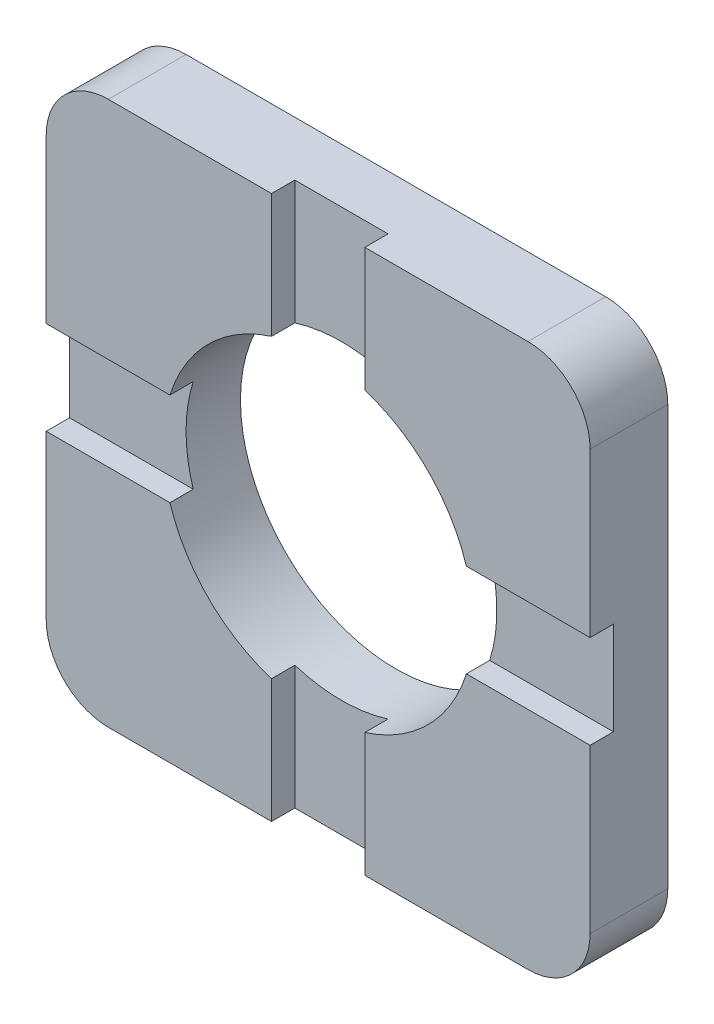
ISO-10303-21;
HEADER;
FILE_DESCRIPTION(('STEP AP214'),'2;1');
FILE_NAME('part.step','',(''),(''),'','','');
FILE_SCHEMA(('AUTOMOTIVE_DESIGN { 1 0 10303 214 1 1 1 1 }'));
ENDSEC;
DATA;
#1=APPLICATION_CONTEXT('core data for automotive mechanical design processes');
#2=APPLICATION_PROTOCOL_DEFINITION('international standard','automotive_design',2000,#1);
#3=PRODUCT_CONTEXT('',#1,'mechanical');
#4=PRODUCT('Part','Part','',(#3));
#5=PRODUCT_RELATED_PRODUCT_CATEGORY('part','',(#4));
#6=PRODUCT_DEFINITION_FORMATION('','',#4);
#7=PRODUCT_DEFINITION_CONTEXT('part definition',#1,'design');
#8=PRODUCT_DEFINITION('design','',#6,#7);
#9=PRODUCT_DEFINITION_SHAPE('','',#8);
#10=(LENGTH_UNIT() NAMED_UNIT(*) SI_UNIT(.MILLI.,.METRE.));
#11=(NAMED_UNIT(*) PLANE_ANGLE_UNIT() SI_UNIT($,.RADIAN.));
#12=(NAMED_UNIT(*) SI_UNIT($,.STERADIAN.) SOLID_ANGLE_UNIT());
#13=UNCERTAINTY_MEASURE_WITH_UNIT(LENGTH_MEASURE(1.E-05),#10,'distance_accuracy_value','');
#14=(GEOMETRIC_REPRESENTATION_CONTEXT(3) GLOBAL_UNCERTAINTY_ASSIGNED_CONTEXT((#13)) GLOBAL_UNIT_ASSIGNED_CONTEXT((#10,
#11,#12)) REPRESENTATION_CONTEXT('',''));
#15=CARTESIAN_POINT('',(0.,0.,0.));
#16=DIRECTION('',(0.,0.,1.));
#17=DIRECTION('',(1.,0.,0.));
#18=AXIS2_PLACEMENT_3D('',#15,#16,#17);
#19=CARTESIAN_POINT('',(0.,0.6,0.7));
#20=DIRECTION('',(0.,1.,0.));
#21=DIRECTION('',(0.,0.,1.));
#22=AXIS2_PLACEMENT_3D('',#19,#20,#21);
#23=PLANE('',#22);
#24=DIRECTION('',(0.,0.,1.));
#25=VECTOR('',#24,1.);
#26=CARTESIAN_POINT('',(-3.5,0.6,0.7));
#27=LINE('',#26,#25);
#28=CARTESIAN_POINT('',(-3.5,0.6,0.7));
#29=VERTEX_POINT('',#28);
#30=CARTESIAN_POINT('',(-3.5,0.6,1.));
#31=VERTEX_POINT('',#30);
#32=EDGE_CURVE('E236',#29,#31,#27,.T.);
#33=ORIENTED_EDGE('',*,*,#32,.F.);
#34=DIRECTION('',(1.,0.,0.));
#35=VECTOR('',#34,1.);
#36=CARTESIAN_POINT('',(0.,0.6,0.7));
#37=LINE('',#36,#35);
#38=CARTESIAN_POINT('',(-1.90787840283389,0.6,0.7));
#39=VERTEX_POINT('',#38);
#40=EDGE_CURVE('E301',#39,#29,#37,.F.);
#41=ORIENTED_EDGE('',*,*,#40,.F.);
#42=DIRECTION('',(0.,0.,1.));
#43=VECTOR('',#42,1.);
#44=CARTESIAN_POINT('',(-1.90787840283389,0.6,0.7));
#45=LINE('',#44,#43);
#46=CARTESIAN_POINT('',(-1.90787840283389,0.6,1.));
#47=VERTEX_POINT('',#46);
#48=EDGE_CURVE('E243',#47,#39,#45,.F.);
#49=ORIENTED_EDGE('',*,*,#48,.F.);
#50=DIRECTION('',(1.,0.,0.));
#51=VECTOR('',#50,1.);
#52=CARTESIAN_POINT('',(-2.7,0.6,1.));
#53=LINE('',#52,#51);
#54=EDGE_CURVE('E351',#31,#47,#53,.T.);
#55=ORIENTED_EDGE('',*,*,#54,.F.);
#56=EDGE_LOOP('',(#33,#41,#49,#55));
#57=FACE_BOUND('',#56,.T.);
#58=ADVANCED_FACE('F17',(#57),#23,.F.);
#59=CARTESIAN_POINT('',(-0.6,0.,0.7));
#60=DIRECTION('',(1.,0.,0.));
#61=DIRECTION('',(0.,0.,-1.));
#62=AXIS2_PLACEMENT_3D('',#59,#60,#61);
#63=PLANE('',#62);
#64=DIRECTION('',(0.,1.,0.));
#65=VECTOR('',#64,1.);
#66=CARTESIAN_POINT('',(-0.6,0.,0.7));
#67=LINE('',#66,#65);
#68=CARTESIAN_POINT('',(-0.6,3.5,0.7));
#69=VERTEX_POINT('',#68);
#70=CARTESIAN_POINT('',(-0.6,1.90787840283389,0.7));
#71=VERTEX_POINT('',#70);
#72=EDGE_CURVE('E356',#69,#71,#67,.F.);
#73=ORIENTED_EDGE('',*,*,#72,.F.);
#74=DIRECTION('',(0.,0.,-1.));
#75=VECTOR('',#74,1.);
#76=CARTESIAN_POINT('',(-0.6,3.5,0.7));
#77=LINE('',#76,#75);
#78=CARTESIAN_POINT('',(-0.6,3.5,1.));
#79=VERTEX_POINT('',#78);
#80=EDGE_CURVE('E224',#69,#79,#77,.F.);
#81=ORIENTED_EDGE('',*,*,#80,.T.);
#82=DIRECTION('',(0.,1.,0.));
#83=VECTOR('',#82,1.);
#84=CARTESIAN_POINT('',(-0.6,-2.7,1.));
#85=LINE('',#84,#83);
#86=CARTESIAN_POINT('',(-0.6,1.90787840283389,1.));
#87=VERTEX_POINT('',#86);
#88=EDGE_CURVE('E337',#87,#79,#85,.T.);
#89=ORIENTED_EDGE('',*,*,#88,.F.);
#90=DIRECTION('',(0.,0.,-1.));
#91=VECTOR('',#90,1.);
#92=CARTESIAN_POINT('',(-0.6,1.90787840283389,0.7));
#93=LINE('',#92,#91);
#94=EDGE_CURVE('E234',#87,#71,#93,.T.);
#95=ORIENTED_EDGE('',*,*,#94,.T.);
#96=EDGE_LOOP('',(#73,#81,#89,#95));
#97=FACE_BOUND('',#96,.T.);
#98=ADVANCED_FACE('F663',(#97),#63,.T.);
#99=CARTESIAN_POINT('',(0.,0.6,0.7));
#100=DIRECTION('',(0.,1.,0.));
#101=DIRECTION('',(0.,0.,1.));
#102=AXIS2_PLACEMENT_3D('',#99,#100,#101);
#103=PLANE('',#102);
#104=DIRECTION('',(0.,0.,1.));
#105=VECTOR('',#104,1.);
#106=CARTESIAN_POINT('',(1.90787840283389,0.6,0.7));
#107=LINE('',#106,#105);
#108=CARTESIAN_POINT('',(1.90787840283389,0.6,0.7));
#109=VERTEX_POINT('',#108);
#110=CARTESIAN_POINT('',(1.90787840283389,0.6,1.));
#111=VERTEX_POINT('',#110);
#112=EDGE_CURVE('E147',#109,#111,#107,.T.);
#113=ORIENTED_EDGE('',*,*,#112,.F.);
#114=DIRECTION('',(1.,0.,0.));
#115=VECTOR('',#114,1.);
#116=CARTESIAN_POINT('',(0.,0.6,0.7));
#117=LINE('',#116,#115);
#118=CARTESIAN_POINT('',(3.5,0.6,0.7));
#119=VERTEX_POINT('',#118);
#120=EDGE_CURVE('E153',#119,#109,#117,.F.);
#121=ORIENTED_EDGE('',*,*,#120,.F.);
#122=DIRECTION('',(0.,0.,1.));
#123=VECTOR('',#122,1.);
#124=CARTESIAN_POINT('',(3.5,0.6,0.7));
#125=LINE('',#124,#123);
#126=CARTESIAN_POINT('',(3.5,0.6,1.));
#127=VERTEX_POINT('',#126);
#128=EDGE_CURVE('E164',#127,#119,#125,.F.);
#129=ORIENTED_EDGE('',*,*,#128,.F.);
#130=DIRECTION('',(1.,0.,0.));
#131=VECTOR('',#130,1.);
#132=CARTESIAN_POINT('',(-2.7,0.6,1.));
#133=LINE('',#132,#131);
#134=EDGE_CURVE('E161',#111,#127,#133,.T.);
#135=ORIENTED_EDGE('',*,*,#134,.F.);
#136=EDGE_LOOP('',(#113,#121,#129,#135));
#137=FACE_BOUND('',#136,.T.);
#138=ADVANCED_FACE('F156',(#137),#103,.F.);
#139=CARTESIAN_POINT('',(0.6,0.,0.7));
#140=DIRECTION('',(1.,0.,0.));
#141=DIRECTION('',(0.,0.,-1.));
#142=AXIS2_PLACEMENT_3D('',#139,#140,#141);
#143=PLANE('',#142);
#144=DIRECTION('',(0.,0.,-1.));
#145=VECTOR('',#144,1.);
#146=CARTESIAN_POINT('',(0.6,3.5,0.7));
#147=LINE('',#146,#145);
#148=CARTESIAN_POINT('',(0.6,3.5,0.7));
#149=VERTEX_POINT('',#148);
#150=CARTESIAN_POINT('',(0.6,3.5,1.));
#151=VERTEX_POINT('',#150);
#152=EDGE_CURVE('E213',#149,#151,#147,.F.);
#153=ORIENTED_EDGE('',*,*,#152,.F.);
#154=DIRECTION('',(0.,1.,0.));
#155=VECTOR('',#154,1.);
#156=CARTESIAN_POINT('',(0.6,0.,0.7));
#157=LINE('',#156,#155);
#158=CARTESIAN_POINT('',(0.6,1.90787840283389,0.7));
#159=VERTEX_POINT('',#158);
#160=EDGE_CURVE('E361',#159,#149,#157,.T.);
#161=ORIENTED_EDGE('',*,*,#160,.F.);
#162=DIRECTION('',(0.,0.,-1.));
#163=VECTOR('',#162,1.);
#164=CARTESIAN_POINT('',(0.6,1.90787840283389,0.7));
#165=LINE('',#164,#163);
#166=CARTESIAN_POINT('',(0.6,1.90787840283389,1.));
#167=VERTEX_POINT('',#166);
#168=EDGE_CURVE('E163',#167,#159,#165,.T.);
#169=ORIENTED_EDGE('',*,*,#168,.F.);
#170=DIRECTION('',(0.,1.,0.));
#171=VECTOR('',#170,1.);
#172=CARTESIAN_POINT('',(0.6,-2.7,1.));
#173=LINE('',#172,#171);
#174=EDGE_CURVE('E369',#151,#167,#173,.F.);
#175=ORIENTED_EDGE('',*,*,#174,.F.);
#176=EDGE_LOOP('',(#153,#161,#169,#175));
#177=FACE_BOUND('',#176,.T.);
#178=ADVANCED_FACE('F646',(#177),#143,.F.);
#179=CARTESIAN_POINT('',(0.,-0.6,0.7));
#180=DIRECTION('',(0.,1.,0.));
#181=DIRECTION('',(0.,0.,1.));
#182=AXIS2_PLACEMENT_3D('',#179,#180,#181);
#183=PLANE('',#182);
#184=DIRECTION('',(1.,0.,0.));
#185=VECTOR('',#184,1.);
#186=CARTESIAN_POINT('',(0.,-0.6,0.7));
#187=LINE('',#186,#185);
#188=CARTESIAN_POINT('',(1.90787840283388,-0.6,0.7));
#189=VERTEX_POINT('',#188);
#190=CARTESIAN_POINT('',(3.5,-0.6,0.7));
#191=VERTEX_POINT('',#190);
#192=EDGE_CURVE('E152',#189,#191,#187,.T.);
#193=ORIENTED_EDGE('',*,*,#192,.F.);
#194=DIRECTION('',(0.,0.,1.));
#195=VECTOR('',#194,1.);
#196=CARTESIAN_POINT('',(1.90787840283388,-0.6,0.7));
#197=LINE('',#196,#195);
#198=CARTESIAN_POINT('',(1.90787840283388,-0.6,1.));
#199=VERTEX_POINT('',#198);
#200=EDGE_CURVE('E150',#189,#199,#197,.T.);
#201=ORIENTED_EDGE('',*,*,#200,.T.);
#202=DIRECTION('',(1.,0.,0.));
#203=VECTOR('',#202,1.);
#204=CARTESIAN_POINT('',(-2.7,-0.6,1.));
#205=LINE('',#204,#203);
#206=CARTESIAN_POINT('',(3.5,-0.6,1.));
#207=VERTEX_POINT('',#206);
#208=EDGE_CURVE('E374',#207,#199,#205,.F.);
#209=ORIENTED_EDGE('',*,*,#208,.F.);
#210=DIRECTION('',(0.,0.,1.));
#211=VECTOR('',#210,1.);
#212=CARTESIAN_POINT('',(3.5,-0.6,0.7));
#213=LINE('',#212,#211);
#214=EDGE_CURVE('E210',#207,#191,#213,.F.);
#215=ORIENTED_EDGE('',*,*,#214,.T.);
#216=EDGE_LOOP('',(#193,#201,#209,#215));
#217=FACE_BOUND('',#216,.T.);
#218=ADVANCED_FACE('F637',(#217),#183,.T.);
#219=CARTESIAN_POINT('',(0.6,0.,0.7));
#220=DIRECTION('',(1.,0.,0.));
#221=DIRECTION('',(0.,0.,-1.));
#222=AXIS2_PLACEMENT_3D('',#219,#220,#221);
#223=PLANE('',#222);
#224=DIRECTION('',(0.,0.,-1.));
#225=VECTOR('',#224,1.);
#226=CARTESIAN_POINT('',(0.6,-1.90787840283389,0.7));
#227=LINE('',#226,#225);
#228=CARTESIAN_POINT('',(0.6,-1.90787840283389,0.7));
#229=VERTEX_POINT('',#228);
#230=CARTESIAN_POINT('',(0.6,-1.90787840283389,1.));
#231=VERTEX_POINT('',#230);
#232=EDGE_CURVE('E195',#229,#231,#227,.F.);
#233=ORIENTED_EDGE('',*,*,#232,.F.);
#234=DIRECTION('',(0.,1.,0.));
#235=VECTOR('',#234,1.);
#236=CARTESIAN_POINT('',(0.6,0.,0.7));
#237=LINE('',#236,#235);
#238=CARTESIAN_POINT('',(0.6,-3.5,0.7));
#239=VERTEX_POINT('',#238);
#240=EDGE_CURVE('E389',#239,#229,#237,.T.);
#241=ORIENTED_EDGE('',*,*,#240,.F.);
#242=DIRECTION('',(0.,0.,-1.));
#243=VECTOR('',#242,1.);
#244=CARTESIAN_POINT('',(0.6,-3.5,0.7));
#245=LINE('',#244,#243);
#246=CARTESIAN_POINT('',(0.6,-3.5,1.));
#247=VERTEX_POINT('',#246);
#248=EDGE_CURVE('E200',#247,#239,#245,.T.);
#249=ORIENTED_EDGE('',*,*,#248,.F.);
#250=DIRECTION('',(0.,1.,0.));
#251=VECTOR('',#250,1.);
#252=CARTESIAN_POINT('',(0.6,-2.7,1.));
#253=LINE('',#252,#251);
#254=EDGE_CURVE('E379',#231,#247,#253,.F.);
#255=ORIENTED_EDGE('',*,*,#254,.F.);
#256=EDGE_LOOP('',(#233,#241,#249,#255));
#257=FACE_BOUND('',#256,.T.);
#258=ADVANCED_FACE('F628',(#257),#223,.F.);
#259=CARTESIAN_POINT('',(-0.6,0.,0.7));
#260=DIRECTION('',(1.,0.,0.));
#261=DIRECTION('',(0.,0.,-1.));
#262=AXIS2_PLACEMENT_3D('',#259,#260,#261);
#263=PLANE('',#262);
#264=DIRECTION('',(0.,1.,0.));
#265=VECTOR('',#264,1.);
#266=CARTESIAN_POINT('',(-0.6,0.,0.7));
#267=LINE('',#266,#265);
#268=CARTESIAN_POINT('',(-0.6,-1.90787840283389,0.7));
#269=VERTEX_POINT('',#268);
#270=CARTESIAN_POINT('',(-0.6,-3.5,0.7));
#271=VERTEX_POINT('',#270);
#272=EDGE_CURVE('E384',#269,#271,#267,.F.);
#273=ORIENTED_EDGE('',*,*,#272,.F.);
#274=DIRECTION('',(0.,0.,-1.));
#275=VECTOR('',#274,1.);
#276=CARTESIAN_POINT('',(-0.6,-1.90787840283389,0.7));
#277=LINE('',#276,#275);
#278=CARTESIAN_POINT('',(-0.6,-1.90787840283389,1.));
#279=VERTEX_POINT('',#278);
#280=EDGE_CURVE('E188',#269,#279,#277,.F.);
#281=ORIENTED_EDGE('',*,*,#280,.T.);
#282=DIRECTION('',(0.,1.,0.));
#283=VECTOR('',#282,1.);
#284=CARTESIAN_POINT('',(-0.6,-2.7,1.));
#285=LINE('',#284,#283);
#286=CARTESIAN_POINT('',(-0.6,-3.5,1.));
#287=VERTEX_POINT('',#286);
#288=EDGE_CURVE('E394',#287,#279,#285,.T.);
#289=ORIENTED_EDGE('',*,*,#288,.F.);
#290=DIRECTION('',(0.,0.,-1.));
#291=VECTOR('',#290,1.);
#292=CARTESIAN_POINT('',(-0.6,-3.5,0.7));
#293=LINE('',#292,#291);
#294=EDGE_CURVE('E192',#287,#271,#293,.T.);
#295=ORIENTED_EDGE('',*,*,#294,.T.);
#296=EDGE_LOOP('',(#273,#281,#289,#295));
#297=FACE_BOUND('',#296,.T.);
#298=ADVANCED_FACE('F619',(#297),#263,.T.);
#299=CARTESIAN_POINT('',(0.,-0.6,0.7));
#300=DIRECTION('',(0.,1.,0.));
#301=DIRECTION('',(0.,0.,1.));
#302=AXIS2_PLACEMENT_3D('',#299,#300,#301);
#303=PLANE('',#302);
#304=DIRECTION('',(1.,0.,0.));
#305=VECTOR('',#304,1.);
#306=CARTESIAN_POINT('',(0.,-0.6,0.7));
#307=LINE('',#306,#305);
#308=CARTESIAN_POINT('',(-3.5,-0.6,0.7));
#309=VERTEX_POINT('',#308);
#310=CARTESIAN_POINT('',(-1.90787840283389,-0.6,0.7));
#311=VERTEX_POINT('',#310);
#312=EDGE_CURVE('E305',#309,#311,#307,.T.);
#313=ORIENTED_EDGE('',*,*,#312,.F.);
#314=DIRECTION('',(0.,0.,1.));
#315=VECTOR('',#314,1.);
#316=CARTESIAN_POINT('',(-3.5,-0.6,0.7));
#317=LINE('',#316,#315);
#318=CARTESIAN_POINT('',(-3.5,-0.6,1.));
#319=VERTEX_POINT('',#318);
#320=EDGE_CURVE('E169',#309,#319,#317,.T.);
#321=ORIENTED_EDGE('',*,*,#320,.T.);
#322=DIRECTION('',(1.,0.,0.));
#323=VECTOR('',#322,1.);
#324=CARTESIAN_POINT('',(-2.7,-0.6,1.));
#325=LINE('',#324,#323);
#326=CARTESIAN_POINT('',(-1.90787840283389,-0.6,1.));
#327=VERTEX_POINT('',#326);
#328=EDGE_CURVE('E207',#327,#319,#325,.F.);
#329=ORIENTED_EDGE('',*,*,#328,.F.);
#330=DIRECTION('',(0.,0.,1.));
#331=VECTOR('',#330,1.);
#332=CARTESIAN_POINT('',(-1.90787840283389,-0.6,0.7));
#333=LINE('',#332,#331);
#334=EDGE_CURVE('E172',#327,#311,#333,.F.);
#335=ORIENTED_EDGE('',*,*,#334,.T.);
#336=EDGE_LOOP('',(#313,#321,#329,#335));
#337=FACE_BOUND('',#336,.T.);
#338=ADVANCED_FACE('F611',(#337),#303,.T.);
#339=CARTESIAN_POINT('',(0.,0.,0.7));
#340=DIRECTION('',(0.,0.,1.));
#341=DIRECTION('',(1.,0.,0.));
#342=AXIS2_PLACEMENT_3D('',#339,#340,#341);
#343=PLANE('',#342);
#344=CARTESIAN_POINT('',(0.,0.,0.7));
#345=DIRECTION('',(0.,0.,-1.));
#346=DIRECTION('',(-1.,0.,0.));
#347=AXIS2_PLACEMENT_3D('',#344,#345,#346);
#348=CIRCLE('',#347,2.);
#349=EDGE_CURVE('E20',#109,#189,#348,.T.);
#350=ORIENTED_EDGE('',*,*,#349,.T.);
#351=ORIENTED_EDGE('',*,*,#192,.T.);
#352=DIRECTION('',(0.,-1.,0.));
#353=VECTOR('',#352,1.);
#354=CARTESIAN_POINT('',(3.5,2.7,0.7));
#355=LINE('',#354,#353);
#356=EDGE_CURVE('E168',#191,#119,#355,.F.);
#357=ORIENTED_EDGE('',*,*,#356,.T.);
#358=ORIENTED_EDGE('',*,*,#120,.T.);
#359=EDGE_LOOP('',(#350,#351,#357,#358));
#360=FACE_BOUND('',#359,.T.);
#361=ADVANCED_FACE('F166',(#360),#343,.T.);
#362=CARTESIAN_POINT('',(0.,0.,0.7));
#363=DIRECTION('',(0.,0.,1.));
#364=DIRECTION('',(1.,0.,0.));
#365=AXIS2_PLACEMENT_3D('',#362,#363,#364);
#366=PLANE('',#365);
#367=DIRECTION('',(0.,1.,0.));
#368=VECTOR('',#367,1.);
#369=CARTESIAN_POINT('',(-3.5,2.7,0.7));
#370=LINE('',#369,#368);
#371=EDGE_CURVE('E248',#29,#309,#370,.F.);
#372=ORIENTED_EDGE('',*,*,#371,.T.);
#373=ORIENTED_EDGE('',*,*,#312,.T.);
#374=CARTESIAN_POINT('',(0.,0.,0.7));
#375=DIRECTION('',(0.,0.,-1.));
#376=DIRECTION('',(-1.,0.,0.));
#377=AXIS2_PLACEMENT_3D('',#374,#375,#376);
#378=CIRCLE('',#377,2.);
#379=EDGE_CURVE('E300',#311,#39,#378,.T.);
#380=ORIENTED_EDGE('',*,*,#379,.T.);
#381=ORIENTED_EDGE('',*,*,#40,.T.);
#382=EDGE_LOOP('',(#372,#373,#380,#381));
#383=FACE_BOUND('',#382,.T.);
#384=ADVANCED_FACE('F595',(#383),#366,.T.);
#385=CARTESIAN_POINT('',(-2.7,-2.7,1.));
#386=DIRECTION('',(0.,0.,1.));
#387=DIRECTION('',(1.,0.,0.));
#388=AXIS2_PLACEMENT_3D('',#385,#386,#387);
#389=PLANE('',#388);
#390=DIRECTION('',(0.,1.,0.));
#391=VECTOR('',#390,1.);
#392=CARTESIAN_POINT('',(-3.5,2.7,1.));
#393=LINE('',#392,#391);
#394=CARTESIAN_POINT('',(-3.5,2.7,1.));
#395=VERTEX_POINT('',#394);
#396=EDGE_CURVE('E252',#395,#31,#393,.F.);
#397=ORIENTED_EDGE('',*,*,#396,.T.);
#398=ORIENTED_EDGE('',*,*,#54,.T.);
#399=CARTESIAN_POINT('',(0.,0.,1.));
#400=DIRECTION('',(0.,0.,-1.));
#401=DIRECTION('',(-1.,0.,0.));
#402=AXIS2_PLACEMENT_3D('',#399,#400,#401);
#403=CIRCLE('',#402,2.);
#404=EDGE_CURVE('E288',#47,#87,#403,.T.);
#405=ORIENTED_EDGE('',*,*,#404,.T.);
#406=ORIENTED_EDGE('',*,*,#88,.T.);
#407=DIRECTION('',(1.,0.,0.));
#408=VECTOR('',#407,1.);
#409=CARTESIAN_POINT('',(-2.7,3.5,1.));
#410=LINE('',#409,#408);
#411=CARTESIAN_POINT('',(-2.7,3.5,1.));
#412=VERTEX_POINT('',#411);
#413=EDGE_CURVE('E324',#79,#412,#410,.F.);
#414=ORIENTED_EDGE('',*,*,#413,.T.);
#415=CARTESIAN_POINT('',(-2.7,2.7,1.));
#416=DIRECTION('',(0.,0.,-1.));
#417=DIRECTION('',(-1.,0.,0.));
#418=AXIS2_PLACEMENT_3D('',#415,#416,#417);
#419=CIRCLE('',#418,0.8);
#420=EDGE_CURVE('E230',#395,#412,#419,.T.);
#421=ORIENTED_EDGE('',*,*,#420,.F.);
#422=EDGE_LOOP('',(#397,#398,#405,#406,#414,#421));
#423=FACE_BOUND('',#422,.T.);
#424=ADVANCED_FACE('F586',(#423),#389,.T.);
#425=CARTESIAN_POINT('',(0.,0.,0.7));
#426=DIRECTION('',(0.,0.,1.));
#427=DIRECTION('',(1.,0.,0.));
#428=AXIS2_PLACEMENT_3D('',#425,#426,#427);
#429=PLANE('',#428);
#430=ORIENTED_EDGE('',*,*,#160,.T.);
#431=DIRECTION('',(1.,0.,0.));
#432=VECTOR('',#431,1.);
#433=CARTESIAN_POINT('',(-2.7,3.5,0.7));
#434=LINE('',#433,#432);
#435=EDGE_CURVE('E227',#149,#69,#434,.F.);
#436=ORIENTED_EDGE('',*,*,#435,.T.);
#437=ORIENTED_EDGE('',*,*,#72,.T.);
#438=CARTESIAN_POINT('',(0.,0.,0.7));
#439=DIRECTION('',(0.,0.,-1.));
#440=DIRECTION('',(-1.,0.,0.));
#441=AXIS2_PLACEMENT_3D('',#438,#439,#440);
#442=CIRCLE('',#441,2.);
#443=EDGE_CURVE('E285',#71,#159,#442,.T.);
#444=ORIENTED_EDGE('',*,*,#443,.T.);
#445=EDGE_LOOP('',(#430,#436,#437,#444));
#446=FACE_BOUND('',#445,.T.);
#447=ADVANCED_FACE('F577',(#446),#429,.T.);
#448=CARTESIAN_POINT('',(-2.7,-2.7,1.));
#449=DIRECTION('',(0.,0.,1.));
#450=DIRECTION('',(1.,0.,0.));
#451=AXIS2_PLACEMENT_3D('',#448,#449,#450);
#452=PLANE('',#451);
#453=ORIENTED_EDGE('',*,*,#174,.T.);
#454=CARTESIAN_POINT('',(0.,0.,1.));
#455=DIRECTION('',(0.,0.,-1.));
#456=DIRECTION('',(-1.,0.,0.));
#457=AXIS2_PLACEMENT_3D('',#454,#455,#456);
#458=CIRCLE('',#457,2.);
#459=EDGE_CURVE('E283',#167,#111,#458,.T.);
#460=ORIENTED_EDGE('',*,*,#459,.T.);
#461=ORIENTED_EDGE('',*,*,#134,.T.);
#462=DIRECTION('',(0.,-1.,0.));
#463=VECTOR('',#462,1.);
#464=CARTESIAN_POINT('',(3.5,2.7,1.));
#465=LINE('',#464,#463);
#466=CARTESIAN_POINT('',(3.5,2.7,1.));
#467=VERTEX_POINT('',#466);
#468=EDGE_CURVE('E256',#127,#467,#465,.F.);
#469=ORIENTED_EDGE('',*,*,#468,.T.);
#470=CARTESIAN_POINT('',(2.7,2.7,1.));
#471=DIRECTION('',(0.,0.,-1.));
#472=DIRECTION('',(-1.,0.,0.));
#473=AXIS2_PLACEMENT_3D('',#470,#471,#472);
#474=CIRCLE('',#473,0.8);
#475=CARTESIAN_POINT('',(2.7,3.5,1.));
#476=VERTEX_POINT('',#475);
#477=EDGE_CURVE('E295',#476,#467,#474,.T.);
#478=ORIENTED_EDGE('',*,*,#477,.F.);
#479=DIRECTION('',(1.,0.,0.));
#480=VECTOR('',#479,1.);
#481=CARTESIAN_POINT('',(-2.7,3.5,1.));
#482=LINE('',#481,#480);
#483=EDGE_CURVE('E231',#476,#151,#482,.F.);
#484=ORIENTED_EDGE('',*,*,#483,.T.);
#485=EDGE_LOOP('',(#453,#460,#461,#469,#478,#484));
#486=FACE_BOUND('',#485,.T.);
#487=ADVANCED_FACE('F568',(#486),#452,.T.);
#488=CARTESIAN_POINT('',(-2.7,-2.7,1.));
#489=DIRECTION('',(0.,0.,1.));
#490=DIRECTION('',(1.,0.,0.));
#491=AXIS2_PLACEMENT_3D('',#488,#489,#490);
#492=PLANE('',#491);
#493=DIRECTION('',(-1.,0.,0.));
#494=VECTOR('',#493,1.);
#495=CARTESIAN_POINT('',(-2.7,-3.5,1.));
#496=LINE('',#495,#494);
#497=CARTESIAN_POINT('',(2.7,-3.5,1.));
#498=VERTEX_POINT('',#497);
#499=EDGE_CURVE('E180',#247,#498,#496,.F.);
#500=ORIENTED_EDGE('',*,*,#499,.T.);
#501=CARTESIAN_POINT('',(2.7,-2.7,1.));
#502=DIRECTION('',(0.,0.,-1.));
#503=DIRECTION('',(-1.,0.,0.));
#504=AXIS2_PLACEMENT_3D('',#501,#502,#503);
#505=CIRCLE('',#504,0.8);
#506=CARTESIAN_POINT('',(3.5,-2.7,1.));
#507=VERTEX_POINT('',#506);
#508=EDGE_CURVE('E299',#507,#498,#505,.T.);
#509=ORIENTED_EDGE('',*,*,#508,.F.);
#510=DIRECTION('',(0.,-1.,0.));
#511=VECTOR('',#510,1.);
#512=CARTESIAN_POINT('',(3.5,2.7,1.));
#513=LINE('',#512,#511);
#514=EDGE_CURVE('E298',#507,#207,#513,.F.);
#515=ORIENTED_EDGE('',*,*,#514,.T.);
#516=ORIENTED_EDGE('',*,*,#208,.T.);
#517=CARTESIAN_POINT('',(0.,0.,1.));
#518=DIRECTION('',(0.,0.,-1.));
#519=DIRECTION('',(-1.,0.,0.));
#520=AXIS2_PLACEMENT_3D('',#517,#518,#519);
#521=CIRCLE('',#520,2.);
#522=EDGE_CURVE('E280',#199,#231,#521,.T.);
#523=ORIENTED_EDGE('',*,*,#522,.T.);
#524=ORIENTED_EDGE('',*,*,#254,.T.);
#525=EDGE_LOOP('',(#500,#509,#515,#516,#523,#524));
#526=FACE_BOUND('',#525,.T.);
#527=ADVANCED_FACE('F559',(#526),#492,.T.);
#528=CARTESIAN_POINT('',(0.,0.,0.7));
#529=DIRECTION('',(0.,0.,1.));
#530=DIRECTION('',(1.,0.,0.));
#531=AXIS2_PLACEMENT_3D('',#528,#529,#530);
#532=PLANE('',#531);
#533=ORIENTED_EDGE('',*,*,#240,.T.);
#534=CARTESIAN_POINT('',(0.,0.,0.7));
#535=DIRECTION('',(0.,0.,-1.));
#536=DIRECTION('',(-1.,0.,0.));
#537=AXIS2_PLACEMENT_3D('',#534,#535,#536);
#538=CIRCLE('',#537,2.);
#539=EDGE_CURVE('E277',#229,#269,#538,.T.);
#540=ORIENTED_EDGE('',*,*,#539,.T.);
#541=ORIENTED_EDGE('',*,*,#272,.T.);
#542=DIRECTION('',(-1.,0.,0.));
#543=VECTOR('',#542,1.);
#544=CARTESIAN_POINT('',(-2.7,-3.5,0.7));
#545=LINE('',#544,#543);
#546=EDGE_CURVE('E184',#271,#239,#545,.F.);
#547=ORIENTED_EDGE('',*,*,#546,.T.);
#548=EDGE_LOOP('',(#533,#540,#541,#547));
#549=FACE_BOUND('',#548,.T.);
#550=ADVANCED_FACE('F550',(#549),#532,.T.);
#551=CARTESIAN_POINT('',(-2.7,-2.7,1.));
#552=DIRECTION('',(0.,0.,1.));
#553=DIRECTION('',(1.,0.,0.));
#554=AXIS2_PLACEMENT_3D('',#551,#552,#553);
#555=PLANE('',#554);
#556=DIRECTION('',(0.,1.,0.));
#557=VECTOR('',#556,1.);
#558=CARTESIAN_POINT('',(-3.5,2.7,1.));
#559=LINE('',#558,#557);
#560=CARTESIAN_POINT('',(-3.5,-2.7,1.));
#561=VERTEX_POINT('',#560);
#562=EDGE_CURVE('E344',#319,#561,#559,.F.);
#563=ORIENTED_EDGE('',*,*,#562,.T.);
#564=CARTESIAN_POINT('',(-2.7,-2.7,1.));
#565=DIRECTION('',(0.,0.,-1.));
#566=DIRECTION('',(-1.,0.,0.));
#567=AXIS2_PLACEMENT_3D('',#564,#565,#566);
#568=CIRCLE('',#567,0.8);
#569=CARTESIAN_POINT('',(-2.7,-3.5,1.));
#570=VERTEX_POINT('',#569);
#571=EDGE_CURVE('E291',#570,#561,#568,.T.);
#572=ORIENTED_EDGE('',*,*,#571,.F.);
#573=DIRECTION('',(-1.,0.,0.));
#574=VECTOR('',#573,1.);
#575=CARTESIAN_POINT('',(-2.7,-3.5,1.));
#576=LINE('',#575,#574);
#577=EDGE_CURVE('E183',#570,#287,#576,.F.);
#578=ORIENTED_EDGE('',*,*,#577,.T.);
#579=ORIENTED_EDGE('',*,*,#288,.T.);
#580=CARTESIAN_POINT('',(0.,0.,1.));
#581=DIRECTION('',(0.,0.,-1.));
#582=DIRECTION('',(-1.,0.,0.));
#583=AXIS2_PLACEMENT_3D('',#580,#581,#582);
#584=CIRCLE('',#583,2.);
#585=EDGE_CURVE('E274',#279,#327,#584,.T.);
#586=ORIENTED_EDGE('',*,*,#585,.T.);
#587=ORIENTED_EDGE('',*,*,#328,.T.);
#588=EDGE_LOOP('',(#563,#572,#578,#579,#586,#587));
#589=FACE_BOUND('',#588,.T.);
#590=ADVANCED_FACE('F542',(#589),#555,.T.);
#591=CARTESIAN_POINT('',(-2.7,-3.5,1.));
#592=DIRECTION('',(0.,1.,0.));
#593=DIRECTION('',(-1.,0.,0.));
#594=AXIS2_PLACEMENT_3D('',#591,#592,#593);
#595=PLANE('',#594);
#596=ORIENTED_EDGE('',*,*,#577,.F.);
#597=DIRECTION('',(0.,0.,-1.));
#598=VECTOR('',#597,1.);
#599=CARTESIAN_POINT('',(-2.7,-3.5,1.));
#600=LINE('',#599,#598);
#601=CARTESIAN_POINT('',(-2.7,-3.5,0.));
#602=VERTEX_POINT('',#601);
#603=EDGE_CURVE('E251',#602,#570,#600,.F.);
#604=ORIENTED_EDGE('',*,*,#603,.F.);
#605=DIRECTION('',(1.,0.,0.));
#606=VECTOR('',#605,1.);
#607=CARTESIAN_POINT('',(-2.7,-3.5,0.));
#608=LINE('',#607,#606);
#609=CARTESIAN_POINT('',(2.7,-3.5,0.));
#610=VERTEX_POINT('',#609);
#611=EDGE_CURVE('E273',#602,#610,#608,.T.);
#612=ORIENTED_EDGE('',*,*,#611,.T.);
#613=DIRECTION('',(0.,0.,-1.));
#614=VECTOR('',#613,1.);
#615=CARTESIAN_POINT('',(2.7,-3.5,1.));
#616=LINE('',#615,#614);
#617=EDGE_CURVE('E257',#498,#610,#616,.T.);
#618=ORIENTED_EDGE('',*,*,#617,.F.);
#619=ORIENTED_EDGE('',*,*,#499,.F.);
#620=ORIENTED_EDGE('',*,*,#248,.T.);
#621=ORIENTED_EDGE('',*,*,#546,.F.);
#622=ORIENTED_EDGE('',*,*,#294,.F.);
#623=EDGE_LOOP('',(#596,#604,#612,#618,#619,#620,#621,#622));
#624=FACE_BOUND('',#623,.T.);
#625=ADVANCED_FACE('F456',(#624),#595,.F.);
#626=CARTESIAN_POINT('',(2.7,-2.7,1.));
#627=DIRECTION('',(0.,0.,-1.));
#628=DIRECTION('',(-1.,0.,0.));
#629=AXIS2_PLACEMENT_3D('',#626,#627,#628);
#630=CYLINDRICAL_SURFACE('',#629,0.8);
#631=ORIENTED_EDGE('',*,*,#508,.T.);
#632=ORIENTED_EDGE('',*,*,#617,.T.);
#633=CARTESIAN_POINT('',(2.7,-2.7,0.));
#634=DIRECTION('',(0.,0.,-1.));
#635=DIRECTION('',(-1.,0.,0.));
#636=AXIS2_PLACEMENT_3D('',#633,#634,#635);
#637=CIRCLE('',#636,0.8);
#638=CARTESIAN_POINT('',(3.5,-2.7,0.));
#639=VERTEX_POINT('',#638);
#640=EDGE_CURVE('E270',#610,#639,#637,.F.);
#641=ORIENTED_EDGE('',*,*,#640,.T.);
#642=DIRECTION('',(0.,0.,1.));
#643=VECTOR('',#642,1.);
#644=CARTESIAN_POINT('',(3.5,-2.7,1.));
#645=LINE('',#644,#643);
#646=EDGE_CURVE('E312',#639,#507,#645,.T.);
#647=ORIENTED_EDGE('',*,*,#646,.T.);
#648=EDGE_LOOP('',(#631,#632,#641,#647));
#649=FACE_BOUND('',#648,.T.);
#650=ADVANCED_FACE('F452',(#649),#630,.T.);
#651=CARTESIAN_POINT('',(3.5,2.7,1.));
#652=DIRECTION('',(-1.,0.,0.));
#653=DIRECTION('',(0.,-1.,0.));
#654=AXIS2_PLACEMENT_3D('',#651,#652,#653);
#655=PLANE('',#654);
#656=ORIENTED_EDGE('',*,*,#514,.F.);
#657=ORIENTED_EDGE('',*,*,#646,.F.);
#658=DIRECTION('',(0.,1.,0.));
#659=VECTOR('',#658,1.);
#660=CARTESIAN_POINT('',(3.5,-2.7,0.));
#661=LINE('',#660,#659);
#662=CARTESIAN_POINT('',(3.5,2.7,0.));
#663=VERTEX_POINT('',#662);
#664=EDGE_CURVE('E269',#639,#663,#661,.T.);
#665=ORIENTED_EDGE('',*,*,#664,.T.);
#666=DIRECTION('',(0.,0.,-1.));
#667=VECTOR('',#666,1.);
#668=CARTESIAN_POINT('',(3.5,2.7,1.));
#669=LINE('',#668,#667);
#670=EDGE_CURVE('E297',#467,#663,#669,.T.);
#671=ORIENTED_EDGE('',*,*,#670,.F.);
#672=ORIENTED_EDGE('',*,*,#468,.F.);
#673=ORIENTED_EDGE('',*,*,#128,.T.);
#674=ORIENTED_EDGE('',*,*,#356,.F.);
#675=ORIENTED_EDGE('',*,*,#214,.F.);
#676=EDGE_LOOP('',(#656,#657,#665,#671,#672,#673,#674,#675));
#677=FACE_BOUND('',#676,.T.);
#678=ADVANCED_FACE('F449',(#677),#655,.F.);
#679=CARTESIAN_POINT('',(2.7,2.7,1.));
#680=DIRECTION('',(0.,0.,-1.));
#681=DIRECTION('',(-1.,0.,0.));
#682=AXIS2_PLACEMENT_3D('',#679,#680,#681);
#683=CYLINDRICAL_SURFACE('',#682,0.8);
#684=ORIENTED_EDGE('',*,*,#477,.T.);
#685=ORIENTED_EDGE('',*,*,#670,.T.);
#686=CARTESIAN_POINT('',(2.7,2.7,0.));
#687=DIRECTION('',(0.,0.,-1.));
#688=DIRECTION('',(-1.,0.,0.));
#689=AXIS2_PLACEMENT_3D('',#686,#687,#688);
#690=CIRCLE('',#689,0.8);
#691=CARTESIAN_POINT('',(2.7,3.5,0.));
#692=VERTEX_POINT('',#691);
#693=EDGE_CURVE('E266',#663,#692,#690,.F.);
#694=ORIENTED_EDGE('',*,*,#693,.T.);
#695=DIRECTION('',(0.,0.,1.));
#696=VECTOR('',#695,1.);
#697=CARTESIAN_POINT('',(2.7,3.5,1.));
#698=LINE('',#697,#696);
#699=EDGE_CURVE('E321',#692,#476,#698,.T.);
#700=ORIENTED_EDGE('',*,*,#699,.T.);
#701=EDGE_LOOP('',(#684,#685,#694,#700));
#702=FACE_BOUND('',#701,.T.);
#703=ADVANCED_FACE('F444',(#702),#683,.T.);
#704=CARTESIAN_POINT('',(-2.7,3.5,1.));
#705=DIRECTION('',(0.,-1.,0.));
#706=DIRECTION('',(1.,0.,0.));
#707=AXIS2_PLACEMENT_3D('',#704,#705,#706);
#708=PLANE('',#707);
#709=ORIENTED_EDGE('',*,*,#435,.F.);
#710=ORIENTED_EDGE('',*,*,#152,.T.);
#711=ORIENTED_EDGE('',*,*,#483,.F.);
#712=ORIENTED_EDGE('',*,*,#699,.F.);
#713=DIRECTION('',(1.,0.,0.));
#714=VECTOR('',#713,1.);
#715=CARTESIAN_POINT('',(-2.7,3.5,0.));
#716=LINE('',#715,#714);
#717=CARTESIAN_POINT('',(-2.7,3.5,0.));
#718=VERTEX_POINT('',#717);
#719=EDGE_CURVE('E265',#692,#718,#716,.F.);
#720=ORIENTED_EDGE('',*,*,#719,.T.);
#721=DIRECTION('',(0.,0.,-1.));
#722=VECTOR('',#721,1.);
#723=CARTESIAN_POINT('',(-2.7,3.5,1.));
#724=LINE('',#723,#722);
#725=EDGE_CURVE('E294',#412,#718,#724,.T.);
#726=ORIENTED_EDGE('',*,*,#725,.F.);
#727=ORIENTED_EDGE('',*,*,#413,.F.);
#728=ORIENTED_EDGE('',*,*,#80,.F.);
#729=EDGE_LOOP('',(#709,#710,#711,#712,#720,#726,#727,#728));
#730=FACE_BOUND('',#729,.T.);
#731=ADVANCED_FACE('F438',(#730),#708,.F.);
#732=CARTESIAN_POINT('',(-2.7,2.7,1.));
#733=DIRECTION('',(0.,0.,-1.));
#734=DIRECTION('',(-1.,0.,0.));
#735=AXIS2_PLACEMENT_3D('',#732,#733,#734);
#736=CYLINDRICAL_SURFACE('',#735,0.8);
#737=ORIENTED_EDGE('',*,*,#420,.T.);
#738=ORIENTED_EDGE('',*,*,#725,.T.);
#739=CARTESIAN_POINT('',(-2.7,2.7,0.));
#740=DIRECTION('',(0.,0.,-1.));
#741=DIRECTION('',(-1.,0.,0.));
#742=AXIS2_PLACEMENT_3D('',#739,#740,#741);
#743=CIRCLE('',#742,0.8);
#744=CARTESIAN_POINT('',(-3.5,2.7,0.));
#745=VERTEX_POINT('',#744);
#746=EDGE_CURVE('E262',#718,#745,#743,.F.);
#747=ORIENTED_EDGE('',*,*,#746,.T.);
#748=DIRECTION('',(0.,0.,1.));
#749=VECTOR('',#748,1.);
#750=CARTESIAN_POINT('',(-3.5,2.7,1.));
#751=LINE('',#750,#749);
#752=EDGE_CURVE('E331',#745,#395,#751,.T.);
#753=ORIENTED_EDGE('',*,*,#752,.T.);
#754=EDGE_LOOP('',(#737,#738,#747,#753));
#755=FACE_BOUND('',#754,.T.);
#756=ADVANCED_FACE('F433',(#755),#736,.T.);
#757=CARTESIAN_POINT('',(-3.5,2.7,1.));
#758=DIRECTION('',(1.,0.,0.));
#759=DIRECTION('',(0.,1.,0.));
#760=AXIS2_PLACEMENT_3D('',#757,#758,#759);
#761=PLANE('',#760);
#762=ORIENTED_EDGE('',*,*,#371,.F.);
#763=ORIENTED_EDGE('',*,*,#32,.T.);
#764=ORIENTED_EDGE('',*,*,#396,.F.);
#765=ORIENTED_EDGE('',*,*,#752,.F.);
#766=DIRECTION('',(0.,1.,0.));
#767=VECTOR('',#766,1.);
#768=CARTESIAN_POINT('',(-3.5,-2.7,0.));
#769=LINE('',#768,#767);
#770=CARTESIAN_POINT('',(-3.5,-2.7,0.));
#771=VERTEX_POINT('',#770);
#772=EDGE_CURVE('E261',#745,#771,#769,.F.);
#773=ORIENTED_EDGE('',*,*,#772,.T.);
#774=DIRECTION('',(0.,0.,-1.));
#775=VECTOR('',#774,1.);
#776=CARTESIAN_POINT('',(-3.5,-2.7,1.));
#777=LINE('',#776,#775);
#778=EDGE_CURVE('E35',#561,#771,#777,.T.);
#779=ORIENTED_EDGE('',*,*,#778,.F.);
#780=ORIENTED_EDGE('',*,*,#562,.F.);
#781=ORIENTED_EDGE('',*,*,#320,.F.);
#782=EDGE_LOOP('',(#762,#763,#764,#765,#773,#779,#780,#781));
#783=FACE_BOUND('',#782,.T.);
#784=ADVANCED_FACE('F425',(#783),#761,.F.);
#785=CARTESIAN_POINT('',(-2.7,-2.7,1.));
#786=DIRECTION('',(0.,0.,-1.));
#787=DIRECTION('',(-1.,0.,0.));
#788=AXIS2_PLACEMENT_3D('',#785,#786,#787);
#789=CYLINDRICAL_SURFACE('',#788,0.8);
#790=ORIENTED_EDGE('',*,*,#571,.T.);
#791=ORIENTED_EDGE('',*,*,#778,.T.);
#792=CARTESIAN_POINT('',(-2.7,-2.7,0.));
#793=DIRECTION('',(0.,0.,-1.));
#794=DIRECTION('',(-1.,0.,0.));
#795=AXIS2_PLACEMENT_3D('',#792,#793,#794);
#796=CIRCLE('',#795,0.8);
#797=EDGE_CURVE('E26',#771,#602,#796,.F.);
#798=ORIENTED_EDGE('',*,*,#797,.T.);
#799=ORIENTED_EDGE('',*,*,#603,.T.);
#800=EDGE_LOOP('',(#790,#791,#798,#799));
#801=FACE_BOUND('',#800,.T.);
#802=ADVANCED_FACE('F461',(#801),#789,.T.);
#803=CARTESIAN_POINT('',(0.,0.,1.));
#804=DIRECTION('',(0.,0.,-1.));
#805=DIRECTION('',(-1.,0.,0.));
#806=AXIS2_PLACEMENT_3D('',#803,#804,#805);
#807=CYLINDRICAL_SURFACE('',#806,2.);
#808=CARTESIAN_POINT('',(0.,0.,0.));
#809=DIRECTION('',(0.,0.,-1.));
#810=DIRECTION('',(-1.,0.,0.));
#811=AXIS2_PLACEMENT_3D('',#808,#809,#810);
#812=CIRCLE('',#811,2.);
#813=CARTESIAN_POINT('',(-2.,0.,0.));
#814=VERTEX_POINT('',#813);
#815=EDGE_CURVE('E11',#814,#814,#812,.T.);
#816=ORIENTED_EDGE('',*,*,#815,.T.);
#817=EDGE_LOOP('',(#816));
#818=FACE_BOUND('',#817,.T.);
#819=ORIENTED_EDGE('',*,*,#349,.F.);
#820=ORIENTED_EDGE('',*,*,#112,.T.);
#821=ORIENTED_EDGE('',*,*,#459,.F.);
#822=ORIENTED_EDGE('',*,*,#168,.T.);
#823=ORIENTED_EDGE('',*,*,#443,.F.);
#824=ORIENTED_EDGE('',*,*,#94,.F.);
#825=ORIENTED_EDGE('',*,*,#404,.F.);
#826=ORIENTED_EDGE('',*,*,#48,.T.);
#827=ORIENTED_EDGE('',*,*,#379,.F.);
#828=ORIENTED_EDGE('',*,*,#334,.F.);
#829=ORIENTED_EDGE('',*,*,#585,.F.);
#830=ORIENTED_EDGE('',*,*,#280,.F.);
#831=ORIENTED_EDGE('',*,*,#539,.F.);
#832=ORIENTED_EDGE('',*,*,#232,.T.);
#833=ORIENTED_EDGE('',*,*,#522,.F.);
#834=ORIENTED_EDGE('',*,*,#200,.F.);
#835=EDGE_LOOP('',(#819,#820,#821,#822,#823,#824,#825,#826,#827,#828,#829,#830,#831,#832,#833,#834));
#836=FACE_BOUND('',#835,.T.);
#837=ADVANCED_FACE('F145',(#818,#836),#807,.F.);
#838=CARTESIAN_POINT('',(-2.7,-2.7,0.));
#839=DIRECTION('',(0.,0.,1.));
#840=DIRECTION('',(1.,0.,0.));
#841=AXIS2_PLACEMENT_3D('',#838,#839,#840);
#842=PLANE('',#841);
#843=ORIENTED_EDGE('',*,*,#815,.F.);
#844=EDGE_LOOP('',(#843));
#845=FACE_BOUND('',#844,.T.);
#846=ORIENTED_EDGE('',*,*,#772,.F.);
#847=ORIENTED_EDGE('',*,*,#746,.F.);
#848=ORIENTED_EDGE('',*,*,#719,.F.);
#849=ORIENTED_EDGE('',*,*,#693,.F.);
#850=ORIENTED_EDGE('',*,*,#664,.F.);
#851=ORIENTED_EDGE('',*,*,#640,.F.);
#852=ORIENTED_EDGE('',*,*,#611,.F.);
#853=ORIENTED_EDGE('',*,*,#797,.F.);
#854=EDGE_LOOP('',(#846,#847,#848,#849,#850,#851,#852,#853));
#855=FACE_BOUND('',#854,.T.);
#856=ADVANCED_FACE('F430',(#845,#855),#842,.F.);
#857=CLOSED_SHELL('',(#58,#98,#138,#178,#218,#258,#298,#338,#361,#384,#424,#447,#487,#527,#550,
#590,#625,#650,#678,#703,#731,#756,#784,#802,#837,#856));
#858=MANIFOLD_SOLID_BREP('B1',#857);
#859=ADVANCED_BREP_SHAPE_REPRESENTATION('',(#18,#858),#14);
#860=SHAPE_DEFINITION_REPRESENTATION(#9,#859);
ENDSEC;
END-ISO-10303-21;
